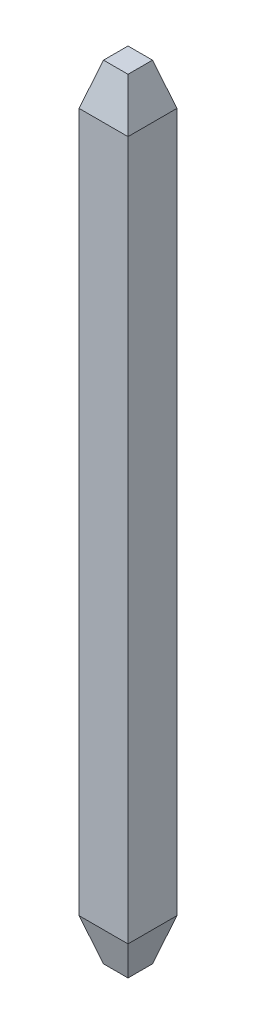
ISO-10303-21;
HEADER;
FILE_DESCRIPTION(('STEP AP214'),'2;1');
FILE_NAME('part.step','',(''),(''),'','','');
FILE_SCHEMA(('AUTOMOTIVE_DESIGN { 1 0 10303 214 1 1 1 1 }'));
ENDSEC;
DATA;
#1=APPLICATION_CONTEXT('core data for automotive mechanical design processes');
#2=APPLICATION_PROTOCOL_DEFINITION('international standard','automotive_design',2000,#1);
#3=PRODUCT_CONTEXT('',#1,'mechanical');
#4=PRODUCT('Part','Part','',(#3));
#5=PRODUCT_RELATED_PRODUCT_CATEGORY('part','',(#4));
#6=PRODUCT_DEFINITION_FORMATION('','',#4);
#7=PRODUCT_DEFINITION_CONTEXT('part definition',#1,'design');
#8=PRODUCT_DEFINITION('design','',#6,#7);
#9=PRODUCT_DEFINITION_SHAPE('','',#8);
#10=(LENGTH_UNIT() NAMED_UNIT(*) SI_UNIT(.MILLI.,.METRE.));
#11=(NAMED_UNIT(*) PLANE_ANGLE_UNIT() SI_UNIT($,.RADIAN.));
#12=(NAMED_UNIT(*) SI_UNIT($,.STERADIAN.) SOLID_ANGLE_UNIT());
#13=UNCERTAINTY_MEASURE_WITH_UNIT(LENGTH_MEASURE(1.E-05),#10,'distance_accuracy_value','');
#14=(GEOMETRIC_REPRESENTATION_CONTEXT(3) GLOBAL_UNCERTAINTY_ASSIGNED_CONTEXT((#13)) GLOBAL_UNIT_ASSIGNED_CONTEXT((#10,
#11,#12)) REPRESENTATION_CONTEXT('',''));
#15=CARTESIAN_POINT('',(0.,0.,0.));
#16=DIRECTION('',(0.,0.,1.));
#17=DIRECTION('',(1.,0.,0.));
#18=AXIS2_PLACEMENT_3D('',#15,#16,#17);
#19=CARTESIAN_POINT('',(-11.269999999987,-0.965870106912693,-16.6599999999763));
#20=DIRECTION('',(0.,0.281214622974643,0.959644900900968));
#21=DIRECTION('',(1.,0.,0.));
#22=AXIS2_PLACEMENT_3D('',#19,#20,#21);
#23=PLANE('',#22);
#24=DIRECTION('',(-0.270714017147727,0.923811583516618,-0.270714017147727));
#25=VECTOR('',#24,1.);
#26=CARTESIAN_POINT('',(-10.949999999987,-0.965870106912693,-16.6599999999763));
#27=LINE('',#26,#25);
#28=CARTESIAN_POINT('',(-10.949999999987,-0.965870106912691,-16.6599999999763));
#29=VERTEX_POINT('',#28);
#30=CARTESIAN_POINT('',(-11.109999999987,-0.419870106912692,-16.8199999999763));
#31=VERTEX_POINT('',#30);
#32=EDGE_CURVE('E11',#29,#31,#27,.T.);
#33=ORIENTED_EDGE('',*,*,#32,.T.);
#34=DIRECTION('',(-1.,0.,0.));
#35=VECTOR('',#34,1.);
#36=CARTESIAN_POINT('',(-11.109999999987,-0.419870106912693,-16.8199999999763));
#37=LINE('',#36,#35);
#38=CARTESIAN_POINT('',(-11.429999999987,-0.419870106912692,-16.8199999999763));
#39=VERTEX_POINT('',#38);
#40=EDGE_CURVE('E28',#31,#39,#37,.T.);
#41=ORIENTED_EDGE('',*,*,#40,.T.);
#42=DIRECTION('',(0.270714017147727,0.923811583516618,-0.270714017147727));
#43=VECTOR('',#42,1.);
#44=CARTESIAN_POINT('',(-11.589999999987,-0.965870106912693,-16.6599999999763));
#45=LINE('',#44,#43);
#46=CARTESIAN_POINT('',(-11.589999999987,-0.965870106912691,-16.6599999999763));
#47=VERTEX_POINT('',#46);
#48=EDGE_CURVE('E127',#47,#39,#45,.T.);
#49=ORIENTED_EDGE('',*,*,#48,.F.);
#50=DIRECTION('',(-1.,0.,0.));
#51=VECTOR('',#50,1.);
#52=CARTESIAN_POINT('',(-10.949999999987,-0.965870106912693,-16.6599999999763));
#53=LINE('',#52,#51);
#54=EDGE_CURVE('E130',#29,#47,#53,.T.);
#55=ORIENTED_EDGE('',*,*,#54,.F.);
#56=EDGE_LOOP('',(#33,#41,#49,#55));
#57=FACE_BOUND('',#56,.T.);
#58=ADVANCED_FACE('F17',(#57),#23,.T.);
#59=CARTESIAN_POINT('',(-10.949999999987,-0.965870106912693,-16.9799999999763));
#60=DIRECTION('',(0.959644900900968,0.281214622974643,0.));
#61=DIRECTION('',(0.,0.,-1.));
#62=AXIS2_PLACEMENT_3D('',#59,#60,#61);
#63=PLANE('',#62);
#64=DIRECTION('',(-0.270714017147727,0.923811583516618,0.270714017147727));
#65=VECTOR('',#64,1.);
#66=CARTESIAN_POINT('',(-10.949999999987,-0.965870106912693,-17.2999999999763));
#67=LINE('',#66,#65);
#68=CARTESIAN_POINT('',(-10.949999999987,-0.965870106912691,-17.2999999999763));
#69=VERTEX_POINT('',#68);
#70=CARTESIAN_POINT('',(-11.109999999987,-0.419870106912692,-17.1399999999763));
#71=VERTEX_POINT('',#70);
#72=EDGE_CURVE('E95',#69,#71,#67,.T.);
#73=ORIENTED_EDGE('',*,*,#72,.T.);
#74=DIRECTION('',(0.,0.,1.));
#75=VECTOR('',#74,1.);
#76=CARTESIAN_POINT('',(-11.109999999987,-0.419870106912693,-17.1399999999763));
#77=LINE('',#76,#75);
#78=EDGE_CURVE('E86',#71,#31,#77,.T.);
#79=ORIENTED_EDGE('',*,*,#78,.T.);
#80=ORIENTED_EDGE('',*,*,#32,.F.);
#81=DIRECTION('',(0.,0.,1.));
#82=VECTOR('',#81,1.);
#83=CARTESIAN_POINT('',(-10.949999999987,-0.965870106912693,-17.2999999999763));
#84=LINE('',#83,#82);
#85=EDGE_CURVE('E21',#69,#29,#84,.T.);
#86=ORIENTED_EDGE('',*,*,#85,.F.);
#87=EDGE_LOOP('',(#73,#79,#80,#86));
#88=FACE_BOUND('',#87,.T.);
#89=ADVANCED_FACE('F99',(#88),#63,.T.);
#90=CARTESIAN_POINT('',(-11.269999999987,-0.965870106912693,-17.2999999999763));
#91=DIRECTION('',(0.,0.281214622974643,-0.959644900900968));
#92=DIRECTION('',(-1.,0.,0.));
#93=AXIS2_PLACEMENT_3D('',#90,#91,#92);
#94=PLANE('',#93);
#95=DIRECTION('',(0.270714017147727,0.923811583516618,0.270714017147727));
#96=VECTOR('',#95,1.);
#97=CARTESIAN_POINT('',(-11.589999999987,-0.965870106912693,-17.2999999999763));
#98=LINE('',#97,#96);
#99=CARTESIAN_POINT('',(-11.589999999987,-0.965870106912691,-17.2999999999763));
#100=VERTEX_POINT('',#99);
#101=CARTESIAN_POINT('',(-11.429999999987,-0.419870106912692,-17.1399999999763));
#102=VERTEX_POINT('',#101);
#103=EDGE_CURVE('E96',#100,#102,#98,.T.);
#104=ORIENTED_EDGE('',*,*,#103,.T.);
#105=DIRECTION('',(1.,0.,0.));
#106=VECTOR('',#105,1.);
#107=CARTESIAN_POINT('',(-11.429999999987,-0.419870106912693,-17.1399999999763));
#108=LINE('',#107,#106);
#109=EDGE_CURVE('E90',#102,#71,#108,.T.);
#110=ORIENTED_EDGE('',*,*,#109,.T.);
#111=ORIENTED_EDGE('',*,*,#72,.F.);
#112=DIRECTION('',(1.,0.,0.));
#113=VECTOR('',#112,1.);
#114=CARTESIAN_POINT('',(-11.589999999987,-0.965870106912693,-17.2999999999763));
#115=LINE('',#114,#113);
#116=EDGE_CURVE('E119',#100,#69,#115,.T.);
#117=ORIENTED_EDGE('',*,*,#116,.F.);
#118=EDGE_LOOP('',(#104,#110,#111,#117));
#119=FACE_BOUND('',#118,.T.);
#120=ADVANCED_FACE('F106',(#119),#94,.T.);
#121=CARTESIAN_POINT('',(-10.948999999987,-5.53443505344795,-17.2999999999763));
#122=DIRECTION('',(0.,0.,-1.));
#123=DIRECTION('',(0.,-1.,0.));
#124=AXIS2_PLACEMENT_3D('',#121,#122,#123);
#125=PLANE('',#124);
#126=DIRECTION('',(0.,1.,0.));
#127=VECTOR('',#126,1.);
#128=CARTESIAN_POINT('',(-10.949999999987,-10.1039999999832,-17.2999999999763));
#129=LINE('',#128,#127);
#130=CARTESIAN_POINT('',(-10.949999999987,-10.1039999999832,-17.2999999999763));
#131=VERTEX_POINT('',#130);
#132=EDGE_CURVE('E148',#131,#69,#129,.T.);
#133=ORIENTED_EDGE('',*,*,#132,.F.);
#134=DIRECTION('',(1.,0.,0.));
#135=VECTOR('',#134,1.);
#136=CARTESIAN_POINT('',(-11.589999999987,-10.1039999999832,-17.2999999999763));
#137=LINE('',#136,#135);
#138=CARTESIAN_POINT('',(-11.589999999987,-10.1039999999832,-17.2999999999763));
#139=VERTEX_POINT('',#138);
#140=EDGE_CURVE('E147',#139,#131,#137,.T.);
#141=ORIENTED_EDGE('',*,*,#140,.F.);
#142=DIRECTION('',(0.,1.,0.));
#143=VECTOR('',#142,1.);
#144=CARTESIAN_POINT('',(-11.589999999987,-10.1039999999832,-17.2999999999763));
#145=LINE('',#144,#143);
#146=EDGE_CURVE('E110',#139,#100,#145,.T.);
#147=ORIENTED_EDGE('',*,*,#146,.T.);
#148=ORIENTED_EDGE('',*,*,#116,.T.);
#149=EDGE_LOOP('',(#133,#141,#147,#148));
#150=FACE_BOUND('',#149,.T.);
#151=ADVANCED_FACE('F318',(#150),#125,.T.);
#152=CARTESIAN_POINT('',(-11.589999999987,-5.53543505344795,-16.6589999999763));
#153=DIRECTION('',(-1.,0.,0.));
#154=DIRECTION('',(0.,0.,1.));
#155=AXIS2_PLACEMENT_3D('',#152,#153,#154);
#156=PLANE('',#155);
#157=ORIENTED_EDGE('',*,*,#146,.F.);
#158=DIRECTION('',(0.,0.,-1.));
#159=VECTOR('',#158,1.);
#160=CARTESIAN_POINT('',(-11.589999999987,-10.1039999999832,-16.6599999999763));
#161=LINE('',#160,#159);
#162=CARTESIAN_POINT('',(-11.589999999987,-10.1039999999832,-16.6599999999763));
#163=VERTEX_POINT('',#162);
#164=EDGE_CURVE('E156',#163,#139,#161,.T.);
#165=ORIENTED_EDGE('',*,*,#164,.F.);
#166=DIRECTION('',(0.,1.,0.));
#167=VECTOR('',#166,1.);
#168=CARTESIAN_POINT('',(-11.589999999987,-10.1039999999832,-16.6599999999763));
#169=LINE('',#168,#167);
#170=EDGE_CURVE('E155',#163,#47,#169,.T.);
#171=ORIENTED_EDGE('',*,*,#170,.T.);
#172=DIRECTION('',(0.,0.,-1.));
#173=VECTOR('',#172,1.);
#174=CARTESIAN_POINT('',(-11.589999999987,-0.965870106912693,-16.6599999999763));
#175=LINE('',#174,#173);
#176=EDGE_CURVE('E160',#47,#100,#175,.T.);
#177=ORIENTED_EDGE('',*,*,#176,.T.);
#178=EDGE_LOOP('',(#157,#165,#171,#177));
#179=FACE_BOUND('',#178,.T.);
#180=ADVANCED_FACE('F334',(#179),#156,.T.);
#181=CARTESIAN_POINT('',(-11.589999999987,-10.1039999999832,-16.9799999999763));
#182=DIRECTION('',(-0.959644900900968,-0.281214622974643,0.));
#183=DIRECTION('',(-0.281214622974643,0.959644900900968,0.));
#184=AXIS2_PLACEMENT_3D('',#181,#182,#183);
#185=PLANE('',#184);
#186=ORIENTED_EDGE('',*,*,#164,.T.);
#187=DIRECTION('',(0.270714017147727,-0.923811583516618,0.270714017147727));
#188=VECTOR('',#187,1.);
#189=CARTESIAN_POINT('',(-11.589999999987,-10.1039999999832,-17.2999999999763));
#190=LINE('',#189,#188);
#191=CARTESIAN_POINT('',(-11.429999999987,-10.6499999999832,-17.1399999999763));
#192=VERTEX_POINT('',#191);
#193=EDGE_CURVE('E142',#139,#192,#190,.T.);
#194=ORIENTED_EDGE('',*,*,#193,.T.);
#195=DIRECTION('',(0.,0.,-1.));
#196=VECTOR('',#195,1.);
#197=CARTESIAN_POINT('',(-11.429999999987,-10.6499999999832,-16.8199999999763));
#198=LINE('',#197,#196);
#199=CARTESIAN_POINT('',(-11.429999999987,-10.6499999999832,-16.8199999999763));
#200=VERTEX_POINT('',#199);
#201=EDGE_CURVE('E132',#200,#192,#198,.T.);
#202=ORIENTED_EDGE('',*,*,#201,.F.);
#203=DIRECTION('',(0.270714017147727,-0.923811583516618,-0.270714017147727));
#204=VECTOR('',#203,1.);
#205=CARTESIAN_POINT('',(-11.589999999987,-10.1039999999832,-16.6599999999763));
#206=LINE('',#205,#204);
#207=EDGE_CURVE('E143',#163,#200,#206,.T.);
#208=ORIENTED_EDGE('',*,*,#207,.F.);
#209=EDGE_LOOP('',(#186,#194,#202,#208));
#210=FACE_BOUND('',#209,.T.);
#211=ADVANCED_FACE('F207',(#210),#185,.T.);
#212=CARTESIAN_POINT('',(-11.269999999987,-10.1039999999832,-16.6599999999763));
#213=DIRECTION('',(0.,-0.281214622974643,0.959644900900968));
#214=DIRECTION('',(-1.,0.,0.));
#215=AXIS2_PLACEMENT_3D('',#212,#213,#214);
#216=PLANE('',#215);
#217=DIRECTION('',(-1.,0.,0.));
#218=VECTOR('',#217,1.);
#219=CARTESIAN_POINT('',(-10.949999999987,-10.1039999999832,-16.6599999999763));
#220=LINE('',#219,#218);
#221=CARTESIAN_POINT('',(-10.949999999987,-10.1039999999832,-16.6599999999763));
#222=VERTEX_POINT('',#221);
#223=EDGE_CURVE('E138',#222,#163,#220,.T.);
#224=ORIENTED_EDGE('',*,*,#223,.T.);
#225=ORIENTED_EDGE('',*,*,#207,.T.);
#226=DIRECTION('',(-1.,0.,0.));
#227=VECTOR('',#226,1.);
#228=CARTESIAN_POINT('',(-11.109999999987,-10.6499999999832,-16.8199999999763));
#229=LINE('',#228,#227);
#230=CARTESIAN_POINT('',(-11.109999999987,-10.6499999999832,-16.8199999999763));
#231=VERTEX_POINT('',#230);
#232=EDGE_CURVE('E136',#231,#200,#229,.T.);
#233=ORIENTED_EDGE('',*,*,#232,.F.);
#234=DIRECTION('',(-0.270714017147727,-0.923811583516618,-0.270714017147727));
#235=VECTOR('',#234,1.);
#236=CARTESIAN_POINT('',(-10.949999999987,-10.1039999999832,-16.6599999999763));
#237=LINE('',#236,#235);
#238=EDGE_CURVE('E170',#222,#231,#237,.T.);
#239=ORIENTED_EDGE('',*,*,#238,.F.);
#240=EDGE_LOOP('',(#224,#225,#233,#239));
#241=FACE_BOUND('',#240,.T.);
#242=ADVANCED_FACE('F303',(#241),#216,.T.);
#243=CARTESIAN_POINT('',(-10.949999999987,-10.1039999999832,-16.9799999999763));
#244=DIRECTION('',(0.959644900900968,-0.281214622974643,0.));
#245=DIRECTION('',(0.,0.,-1.));
#246=AXIS2_PLACEMENT_3D('',#243,#244,#245);
#247=PLANE('',#246);
#248=DIRECTION('',(0.,0.,1.));
#249=VECTOR('',#248,1.);
#250=CARTESIAN_POINT('',(-10.949999999987,-10.1039999999832,-17.2999999999763));
#251=LINE('',#250,#249);
#252=EDGE_CURVE('E173',#131,#222,#251,.T.);
#253=ORIENTED_EDGE('',*,*,#252,.T.);
#254=ORIENTED_EDGE('',*,*,#238,.T.);
#255=DIRECTION('',(0.,0.,1.));
#256=VECTOR('',#255,1.);
#257=CARTESIAN_POINT('',(-11.109999999987,-10.6499999999832,-17.1399999999763));
#258=LINE('',#257,#256);
#259=CARTESIAN_POINT('',(-11.109999999987,-10.6499999999832,-17.1399999999763));
#260=VERTEX_POINT('',#259);
#261=EDGE_CURVE('E123',#260,#231,#258,.T.);
#262=ORIENTED_EDGE('',*,*,#261,.F.);
#263=DIRECTION('',(-0.270714017147727,-0.923811583516618,0.270714017147727));
#264=VECTOR('',#263,1.);
#265=CARTESIAN_POINT('',(-10.949999999987,-10.1039999999832,-17.2999999999763));
#266=LINE('',#265,#264);
#267=EDGE_CURVE('E144',#131,#260,#266,.T.);
#268=ORIENTED_EDGE('',*,*,#267,.F.);
#269=EDGE_LOOP('',(#253,#254,#262,#268));
#270=FACE_BOUND('',#269,.T.);
#271=ADVANCED_FACE('F216',(#270),#247,.T.);
#272=CARTESIAN_POINT('',(-11.430999999987,-10.6499999999832,-16.9799999999763));
#273=DIRECTION('',(0.,-1.,0.));
#274=DIRECTION('',(0.,0.,-1.));
#275=AXIS2_PLACEMENT_3D('',#272,#273,#274);
#276=PLANE('',#275);
#277=ORIENTED_EDGE('',*,*,#261,.T.);
#278=ORIENTED_EDGE('',*,*,#232,.T.);
#279=ORIENTED_EDGE('',*,*,#201,.T.);
#280=DIRECTION('',(1.,0.,0.));
#281=VECTOR('',#280,1.);
#282=CARTESIAN_POINT('',(-11.429999999987,-10.6499999999832,-17.1399999999763));
#283=LINE('',#282,#281);
#284=EDGE_CURVE('E137',#192,#260,#283,.T.);
#285=ORIENTED_EDGE('',*,*,#284,.T.);
#286=EDGE_LOOP('',(#277,#278,#279,#285));
#287=FACE_BOUND('',#286,.T.);
#288=ADVANCED_FACE('F343',(#287),#276,.T.);
#289=CARTESIAN_POINT('',(-11.269999999987,-10.1039999999832,-17.2999999999763));
#290=DIRECTION('',(0.,-0.281214622974643,-0.959644900900968));
#291=DIRECTION('',(0.,-0.959644900900968,0.281214622974643));
#292=AXIS2_PLACEMENT_3D('',#289,#290,#291);
#293=PLANE('',#292);
#294=ORIENTED_EDGE('',*,*,#140,.T.);
#295=ORIENTED_EDGE('',*,*,#267,.T.);
#296=ORIENTED_EDGE('',*,*,#284,.F.);
#297=ORIENTED_EDGE('',*,*,#193,.F.);
#298=EDGE_LOOP('',(#294,#295,#296,#297));
#299=FACE_BOUND('',#298,.T.);
#300=ADVANCED_FACE('F210',(#299),#293,.T.);
#301=CARTESIAN_POINT('',(-10.949999999987,-11.0738701069127,-16.9799999999763));
#302=DIRECTION('',(1.,0.,0.));
#303=DIRECTION('',(0.,1.,0.));
#304=AXIS2_PLACEMENT_3D('',#301,#302,#303);
#305=PLANE('',#304);
#306=DIRECTION('',(0.,1.,0.));
#307=VECTOR('',#306,1.);
#308=CARTESIAN_POINT('',(-10.949999999987,-10.1039999999832,-16.6599999999763));
#309=LINE('',#308,#307);
#310=EDGE_CURVE('E167',#222,#29,#309,.T.);
#311=ORIENTED_EDGE('',*,*,#310,.F.);
#312=ORIENTED_EDGE('',*,*,#252,.F.);
#313=ORIENTED_EDGE('',*,*,#132,.T.);
#314=ORIENTED_EDGE('',*,*,#85,.T.);
#315=EDGE_LOOP('',(#311,#312,#313,#314));
#316=FACE_BOUND('',#315,.T.);
#317=ADVANCED_FACE('F19',(#316),#305,.T.);
#318=CARTESIAN_POINT('',(-11.590999999987,-5.53543505344795,-16.6599999999763));
#319=DIRECTION('',(0.,0.,1.));
#320=DIRECTION('',(1.,0.,0.));
#321=AXIS2_PLACEMENT_3D('',#318,#319,#320);
#322=PLANE('',#321);
#323=ORIENTED_EDGE('',*,*,#170,.F.);
#324=ORIENTED_EDGE('',*,*,#223,.F.);
#325=ORIENTED_EDGE('',*,*,#310,.T.);
#326=ORIENTED_EDGE('',*,*,#54,.T.);
#327=EDGE_LOOP('',(#323,#324,#325,#326));
#328=FACE_BOUND('',#327,.T.);
#329=ADVANCED_FACE('F291',(#328),#322,.T.);
#330=CARTESIAN_POINT('',(-11.589999999987,-0.965870106912693,-16.9799999999763));
#331=DIRECTION('',(-0.959644900900968,0.281214622974643,0.));
#332=DIRECTION('',(0.,0.,1.));
#333=AXIS2_PLACEMENT_3D('',#330,#331,#332);
#334=PLANE('',#333);
#335=ORIENTED_EDGE('',*,*,#48,.T.);
#336=DIRECTION('',(0.,0.,-1.));
#337=VECTOR('',#336,1.);
#338=CARTESIAN_POINT('',(-11.429999999987,-0.419870106912693,-16.8199999999763));
#339=LINE('',#338,#337);
#340=EDGE_CURVE('E131',#39,#102,#339,.T.);
#341=ORIENTED_EDGE('',*,*,#340,.T.);
#342=ORIENTED_EDGE('',*,*,#103,.F.);
#343=ORIENTED_EDGE('',*,*,#176,.F.);
#344=EDGE_LOOP('',(#335,#341,#342,#343));
#345=FACE_BOUND('',#344,.T.);
#346=ADVANCED_FACE('F296',(#345),#334,.T.);
#347=CARTESIAN_POINT('',(-11.269999999987,-0.419870106912693,-17.1409999999763));
#348=DIRECTION('',(0.,1.,0.));
#349=DIRECTION('',(1.,0.,0.));
#350=AXIS2_PLACEMENT_3D('',#347,#348,#349);
#351=PLANE('',#350);
#352=ORIENTED_EDGE('',*,*,#109,.F.);
#353=ORIENTED_EDGE('',*,*,#340,.F.);
#354=ORIENTED_EDGE('',*,*,#40,.F.);
#355=ORIENTED_EDGE('',*,*,#78,.F.);
#356=EDGE_LOOP('',(#352,#353,#354,#355));
#357=FACE_BOUND('',#356,.T.);
#358=ADVANCED_FACE('F88',(#357),#351,.T.);
#359=CLOSED_SHELL('',(#58,#89,#120,#151,#180,#211,#242,#271,#288,#300,#317,#329,#346,#358));
#360=MANIFOLD_SOLID_BREP('B1',#359);
#361=ADVANCED_BREP_SHAPE_REPRESENTATION('',(#18,#360),#14);
#362=SHAPE_DEFINITION_REPRESENTATION(#9,#361);
ENDSEC;
END-ISO-10303-21;
